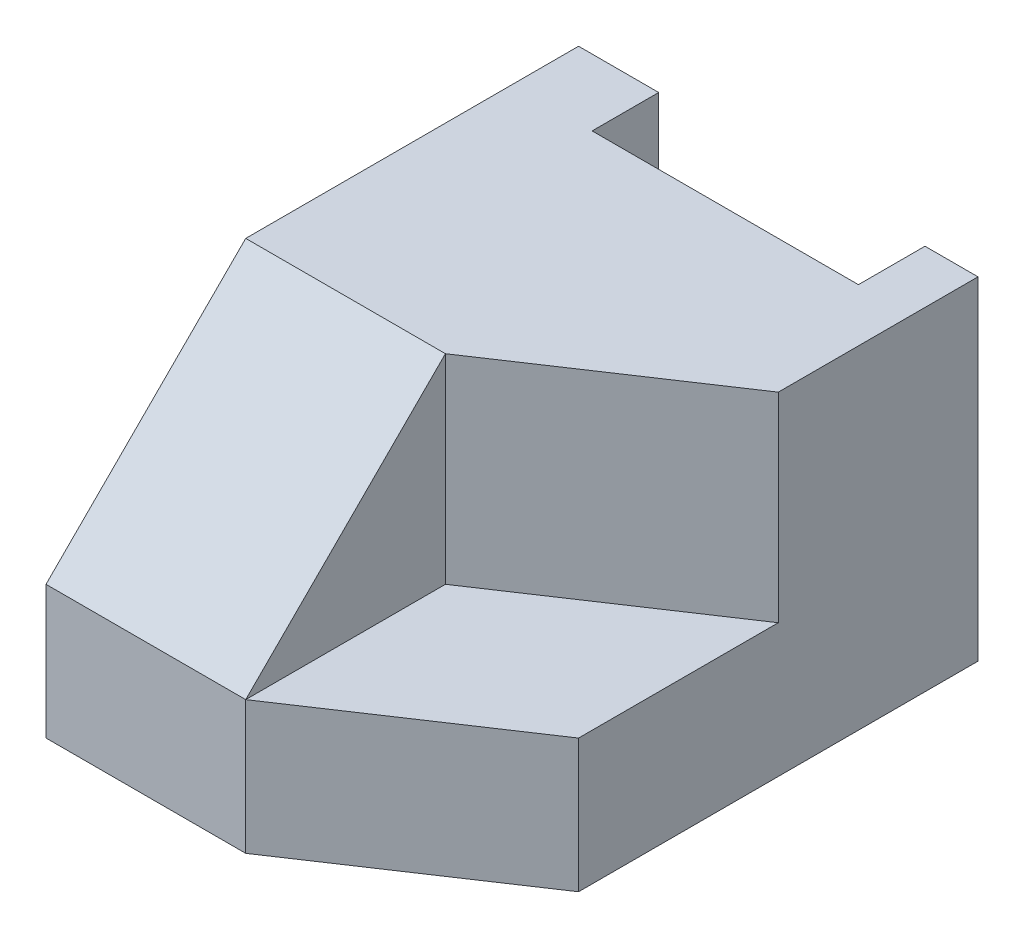
ISO-10303-21;
HEADER;
FILE_DESCRIPTION(('STEP AP214'),'2;1');
FILE_NAME('part.step','',(''),(''),'','','');
FILE_SCHEMA(('AUTOMOTIVE_DESIGN { 1 0 10303 214 1 1 1 1 }'));
ENDSEC;
DATA;
#1=APPLICATION_CONTEXT('core data for automotive mechanical design processes');
#2=APPLICATION_PROTOCOL_DEFINITION('international standard','automotive_design',2000,#1);
#3=PRODUCT_CONTEXT('',#1,'mechanical');
#4=PRODUCT('Part','Part','',(#3));
#5=PRODUCT_RELATED_PRODUCT_CATEGORY('part','',(#4));
#6=PRODUCT_DEFINITION_FORMATION('','',#4);
#7=PRODUCT_DEFINITION_CONTEXT('part definition',#1,'design');
#8=PRODUCT_DEFINITION('design','',#6,#7);
#9=PRODUCT_DEFINITION_SHAPE('','',#8);
#10=(LENGTH_UNIT() NAMED_UNIT(*) SI_UNIT(.MILLI.,.METRE.));
#11=(NAMED_UNIT(*) PLANE_ANGLE_UNIT() SI_UNIT($,.RADIAN.));
#12=(NAMED_UNIT(*) SI_UNIT($,.STERADIAN.) SOLID_ANGLE_UNIT());
#13=UNCERTAINTY_MEASURE_WITH_UNIT(LENGTH_MEASURE(1.E-05),#10,'distance_accuracy_value','');
#14=(GEOMETRIC_REPRESENTATION_CONTEXT(3) GLOBAL_UNCERTAINTY_ASSIGNED_CONTEXT((#13)) GLOBAL_UNIT_ASSIGNED_CONTEXT((#10,
#11,#12)) REPRESENTATION_CONTEXT('',''));
#15=CARTESIAN_POINT('',(0.,0.,0.));
#16=DIRECTION('',(0.,0.,1.));
#17=DIRECTION('',(1.,0.,0.));
#18=AXIS2_PLACEMENT_3D('',#15,#16,#17);
#19=CARTESIAN_POINT('',(-30.,50.,-40.));
#20=DIRECTION('',(0.,0.,1.));
#21=DIRECTION('',(1.,0.,0.));
#22=AXIS2_PLACEMENT_3D('',#19,#20,#21);
#23=PLANE('',#22);
#24=DIRECTION('',(-1.,0.,0.));
#25=VECTOR('',#24,1.);
#26=CARTESIAN_POINT('',(-30.,0.,-40.));
#27=LINE('',#26,#25);
#28=CARTESIAN_POINT('',(30.,0.,-40.));
#29=VERTEX_POINT('',#28);
#30=CARTESIAN_POINT('',(22.0372338214082,0.,-40.));
#31=VERTEX_POINT('',#30);
#32=EDGE_CURVE('E170',#29,#31,#27,.T.);
#33=ORIENTED_EDGE('',*,*,#32,.T.);
#34=DIRECTION('',(0.,1.,0.));
#35=VECTOR('',#34,1.);
#36=CARTESIAN_POINT('',(22.0372338214082,0.,-40.));
#37=LINE('',#36,#35);
#38=CARTESIAN_POINT('',(22.0372338214082,50.,-40.));
#39=VERTEX_POINT('',#38);
#40=EDGE_CURVE('E183',#31,#39,#37,.T.);
#41=ORIENTED_EDGE('',*,*,#40,.T.);
#42=DIRECTION('',(-1.,0.,0.));
#43=VECTOR('',#42,1.);
#44=CARTESIAN_POINT('',(-30.,50.,-40.));
#45=LINE('',#44,#43);
#46=CARTESIAN_POINT('',(30.,50.,-40.));
#47=VERTEX_POINT('',#46);
#48=EDGE_CURVE('E178',#47,#39,#45,.T.);
#49=ORIENTED_EDGE('',*,*,#48,.F.);
#50=DIRECTION('',(0.,-1.,0.));
#51=VECTOR('',#50,1.);
#52=CARTESIAN_POINT('',(30.,50.,-40.));
#53=LINE('',#52,#51);
#54=EDGE_CURVE('E156',#47,#29,#53,.T.);
#55=ORIENTED_EDGE('',*,*,#54,.T.);
#56=EDGE_LOOP('',(#33,#41,#49,#55));
#57=FACE_BOUND('',#56,.T.);
#58=ADVANCED_FACE('F33',(#57),#23,.F.);
#59=CARTESIAN_POINT('',(30.,50.,40.));
#60=DIRECTION('',(-1.,0.,0.));
#61=DIRECTION('',(0.,0.,1.));
#62=AXIS2_PLACEMENT_3D('',#59,#60,#61);
#63=PLANE('',#62);
#64=DIRECTION('',(0.,0.,-1.));
#65=VECTOR('',#64,1.);
#66=CARTESIAN_POINT('',(30.,20.,-10.));
#67=LINE('',#66,#65);
#68=CARTESIAN_POINT('',(30.,20.,20.));
#69=VERTEX_POINT('',#68);
#70=CARTESIAN_POINT('',(30.,20.,-10.));
#71=VERTEX_POINT('',#70);
#72=EDGE_CURVE('E151',#69,#71,#67,.T.);
#73=ORIENTED_EDGE('',*,*,#72,.F.);
#74=DIRECTION('',(0.,1.,0.));
#75=VECTOR('',#74,1.);
#76=CARTESIAN_POINT('',(30.,-9.99999999999999,20.));
#77=LINE('',#76,#75);
#78=CARTESIAN_POINT('',(30.,0.,20.));
#79=VERTEX_POINT('',#78);
#80=EDGE_CURVE('E138',#79,#69,#77,.T.);
#81=ORIENTED_EDGE('',*,*,#80,.F.);
#82=DIRECTION('',(0.,0.,-1.));
#83=VECTOR('',#82,1.);
#84=CARTESIAN_POINT('',(30.,0.,40.));
#85=LINE('',#84,#83);
#86=EDGE_CURVE('E174',#79,#29,#85,.T.);
#87=ORIENTED_EDGE('',*,*,#86,.T.);
#88=ORIENTED_EDGE('',*,*,#54,.F.);
#89=DIRECTION('',(0.,0.,-1.));
#90=VECTOR('',#89,1.);
#91=CARTESIAN_POINT('',(30.,50.,40.));
#92=LINE('',#91,#90);
#93=CARTESIAN_POINT('',(30.,50.,-10.));
#94=VERTEX_POINT('',#93);
#95=EDGE_CURVE('E166',#94,#47,#92,.T.);
#96=ORIENTED_EDGE('',*,*,#95,.F.);
#97=DIRECTION('',(0.,1.,0.));
#98=VECTOR('',#97,1.);
#99=CARTESIAN_POINT('',(30.,20.,-10.));
#100=LINE('',#99,#98);
#101=EDGE_CURVE('E208',#71,#94,#100,.T.);
#102=ORIENTED_EDGE('',*,*,#101,.F.);
#103=EDGE_LOOP('',(#73,#81,#87,#88,#96,#102));
#104=FACE_BOUND('',#103,.T.);
#105=ADVANCED_FACE('F218',(#104),#63,.F.);
#106=CARTESIAN_POINT('',(-17.9627661785918,50.,-40.));
#107=VERTEX_POINT('',#106);
#108=CARTESIAN_POINT('',(-30.,50.,-40.));
#109=VERTEX_POINT('',#108);
#110=EDGE_CURVE('E181',#107,#109,#45,.T.);
#111=ORIENTED_EDGE('',*,*,#110,.F.);
#112=DIRECTION('',(0.,1.,0.));
#113=VECTOR('',#112,1.);
#114=CARTESIAN_POINT('',(-17.9627661785918,0.,-40.));
#115=LINE('',#114,#113);
#116=CARTESIAN_POINT('',(-17.9627661785918,0.,-40.));
#117=VERTEX_POINT('',#116);
#118=EDGE_CURVE('E186',#117,#107,#115,.T.);
#119=ORIENTED_EDGE('',*,*,#118,.F.);
#120=CARTESIAN_POINT('',(-30.,0.,-40.));
#121=VERTEX_POINT('',#120);
#122=EDGE_CURVE('E173',#117,#121,#27,.T.);
#123=ORIENTED_EDGE('',*,*,#122,.T.);
#124=DIRECTION('',(0.,-1.,0.));
#125=VECTOR('',#124,1.);
#126=CARTESIAN_POINT('',(-30.,50.,-40.));
#127=LINE('',#126,#125);
#128=EDGE_CURVE('E159',#109,#121,#127,.T.);
#129=ORIENTED_EDGE('',*,*,#128,.F.);
#130=EDGE_LOOP('',(#111,#119,#123,#129));
#131=FACE_BOUND('',#130,.T.);
#132=ADVANCED_FACE('F244',(#131),#23,.F.);
#133=CARTESIAN_POINT('',(-30.,50.,40.));
#134=DIRECTION('',(1.,0.,0.));
#135=DIRECTION('',(0.,0.,-1.));
#136=AXIS2_PLACEMENT_3D('',#133,#134,#135);
#137=PLANE('',#136);
#138=DIRECTION('',(0.,-1.,0.));
#139=VECTOR('',#138,1.);
#140=CARTESIAN_POINT('',(-30.,50.,40.));
#141=LINE('',#140,#139);
#142=CARTESIAN_POINT('',(-30.,19.9999999999999,40.));
#143=VERTEX_POINT('',#142);
#144=CARTESIAN_POINT('',(-30.,0.,40.));
#145=VERTEX_POINT('',#144);
#146=EDGE_CURVE('E162',#143,#145,#141,.T.);
#147=ORIENTED_EDGE('',*,*,#146,.F.);
#148=DIRECTION('',(0.,-0.707106781186549,0.707106781186546));
#149=VECTOR('',#148,1.);
#150=CARTESIAN_POINT('',(-30.,50.,9.99999999999998));
#151=LINE('',#150,#149);
#152=CARTESIAN_POINT('',(-30.,50.,9.99999999999999));
#153=VERTEX_POINT('',#152);
#154=EDGE_CURVE('E11',#143,#153,#151,.F.);
#155=ORIENTED_EDGE('',*,*,#154,.T.);
#156=DIRECTION('',(0.,0.,1.));
#157=VECTOR('',#156,1.);
#158=CARTESIAN_POINT('',(-30.,50.,40.));
#159=LINE('',#158,#157);
#160=EDGE_CURVE('E164',#109,#153,#159,.T.);
#161=ORIENTED_EDGE('',*,*,#160,.F.);
#162=ORIENTED_EDGE('',*,*,#128,.T.);
#163=DIRECTION('',(0.,0.,1.));
#164=VECTOR('',#163,1.);
#165=CARTESIAN_POINT('',(-30.,0.,40.));
#166=LINE('',#165,#164);
#167=EDGE_CURVE('E167',#121,#145,#166,.T.);
#168=ORIENTED_EDGE('',*,*,#167,.T.);
#169=EDGE_LOOP('',(#147,#155,#161,#162,#168));
#170=FACE_BOUND('',#169,.T.);
#171=ADVANCED_FACE('F250',(#170),#137,.F.);
#172=CARTESIAN_POINT('',(-30.,50.,40.));
#173=DIRECTION('',(0.,0.,-1.));
#174=DIRECTION('',(-1.,0.,0.));
#175=AXIS2_PLACEMENT_3D('',#172,#173,#174);
#176=PLANE('',#175);
#177=DIRECTION('',(0.,1.,0.));
#178=VECTOR('',#177,1.);
#179=CARTESIAN_POINT('',(0.,-9.99999999999999,40.));
#180=LINE('',#179,#178);
#181=CARTESIAN_POINT('',(0.,0.,40.));
#182=VERTEX_POINT('',#181);
#183=CARTESIAN_POINT('',(0.,20.,40.));
#184=VERTEX_POINT('',#183);
#185=EDGE_CURVE('E135',#182,#184,#180,.T.);
#186=ORIENTED_EDGE('',*,*,#185,.T.);
#187=DIRECTION('',(-1.,0.,0.));
#188=VECTOR('',#187,1.);
#189=CARTESIAN_POINT('',(-30.,19.9999999999999,40.));
#190=LINE('',#189,#188);
#191=EDGE_CURVE('E41',#184,#143,#190,.T.);
#192=ORIENTED_EDGE('',*,*,#191,.T.);
#193=ORIENTED_EDGE('',*,*,#146,.T.);
#194=DIRECTION('',(1.,0.,0.));
#195=VECTOR('',#194,1.);
#196=CARTESIAN_POINT('',(-30.,0.,40.));
#197=LINE('',#196,#195);
#198=EDGE_CURVE('E145',#145,#182,#197,.T.);
#199=ORIENTED_EDGE('',*,*,#198,.T.);
#200=EDGE_LOOP('',(#186,#192,#193,#199));
#201=FACE_BOUND('',#200,.T.);
#202=ADVANCED_FACE('F143',(#201),#176,.F.);
#203=CARTESIAN_POINT('',(0.,50.,0.));
#204=DIRECTION('',(0.,-1.,0.));
#205=DIRECTION('',(0.,0.,-1.));
#206=AXIS2_PLACEMENT_3D('',#203,#204,#205);
#207=PLANE('',#206);
#208=ORIENTED_EDGE('',*,*,#160,.T.);
#209=DIRECTION('',(1.,0.,0.));
#210=VECTOR('',#209,1.);
#211=CARTESIAN_POINT('',(0.,50.,9.99999999999998));
#212=LINE('',#211,#210);
#213=CARTESIAN_POINT('',(0.,50.,9.99999999999999));
#214=VERTEX_POINT('',#213);
#215=EDGE_CURVE('E129',#153,#214,#212,.T.);
#216=ORIENTED_EDGE('',*,*,#215,.T.);
#217=DIRECTION('',(-0.832050294337843,0.,0.554700196225229));
#218=VECTOR('',#217,1.);
#219=CARTESIAN_POINT('',(0.,50.,9.99999999999999));
#220=LINE('',#219,#218);
#221=EDGE_CURVE('E152',#94,#214,#220,.T.);
#222=ORIENTED_EDGE('',*,*,#221,.F.);
#223=ORIENTED_EDGE('',*,*,#95,.T.);
#224=ORIENTED_EDGE('',*,*,#48,.T.);
#225=DIRECTION('',(0.,0.,-1.));
#226=VECTOR('',#225,1.);
#227=CARTESIAN_POINT('',(22.0372338214082,50.,-40.));
#228=LINE('',#227,#226);
#229=CARTESIAN_POINT('',(22.0372338214082,50.,-30.));
#230=VERTEX_POINT('',#229);
#231=EDGE_CURVE('E199',#230,#39,#228,.T.);
#232=ORIENTED_EDGE('',*,*,#231,.F.);
#233=DIRECTION('',(1.,0.,0.));
#234=VECTOR('',#233,1.);
#235=CARTESIAN_POINT('',(22.0372338214082,50.,-30.));
#236=LINE('',#235,#234);
#237=CARTESIAN_POINT('',(-17.9627661785918,50.,-30.));
#238=VERTEX_POINT('',#237);
#239=EDGE_CURVE('E192',#238,#230,#236,.T.);
#240=ORIENTED_EDGE('',*,*,#239,.F.);
#241=DIRECTION('',(0.,0.,1.));
#242=VECTOR('',#241,1.);
#243=CARTESIAN_POINT('',(-17.9627661785918,50.,-40.));
#244=LINE('',#243,#242);
#245=EDGE_CURVE('E196',#107,#238,#244,.T.);
#246=ORIENTED_EDGE('',*,*,#245,.F.);
#247=ORIENTED_EDGE('',*,*,#110,.T.);
#248=EDGE_LOOP('',(#208,#216,#222,#223,#224,#232,#240,#246,#247));
#249=FACE_BOUND('',#248,.T.);
#250=ADVANCED_FACE('F229',(#249),#207,.F.);
#251=CARTESIAN_POINT('',(0.,0.,0.));
#252=DIRECTION('',(0.,-1.,0.));
#253=DIRECTION('',(0.,0.,-1.));
#254=AXIS2_PLACEMENT_3D('',#251,#252,#253);
#255=PLANE('',#254);
#256=DIRECTION('',(0.832050294337844,0.,-0.554700196225229));
#257=VECTOR('',#256,1.);
#258=CARTESIAN_POINT('',(18.4615384615385,0.,27.6923076923077));
#259=LINE('',#258,#257);
#260=EDGE_CURVE('E146',#182,#79,#259,.T.);
#261=ORIENTED_EDGE('',*,*,#260,.F.);
#262=ORIENTED_EDGE('',*,*,#198,.F.);
#263=ORIENTED_EDGE('',*,*,#167,.F.);
#264=ORIENTED_EDGE('',*,*,#122,.F.);
#265=DIRECTION('',(0.,0.,1.));
#266=VECTOR('',#265,1.);
#267=CARTESIAN_POINT('',(-17.9627661785918,0.,-40.));
#268=LINE('',#267,#266);
#269=CARTESIAN_POINT('',(-17.9627661785918,0.,-30.));
#270=VERTEX_POINT('',#269);
#271=EDGE_CURVE('E203',#117,#270,#268,.T.);
#272=ORIENTED_EDGE('',*,*,#271,.T.);
#273=DIRECTION('',(1.,0.,0.));
#274=VECTOR('',#273,1.);
#275=CARTESIAN_POINT('',(22.0372338214082,0.,-30.));
#276=LINE('',#275,#274);
#277=CARTESIAN_POINT('',(22.0372338214082,0.,-30.));
#278=VERTEX_POINT('',#277);
#279=EDGE_CURVE('E187',#270,#278,#276,.T.);
#280=ORIENTED_EDGE('',*,*,#279,.T.);
#281=DIRECTION('',(0.,0.,-1.));
#282=VECTOR('',#281,1.);
#283=CARTESIAN_POINT('',(22.0372338214082,0.,-40.));
#284=LINE('',#283,#282);
#285=EDGE_CURVE('E195',#278,#31,#284,.T.);
#286=ORIENTED_EDGE('',*,*,#285,.T.);
#287=ORIENTED_EDGE('',*,*,#32,.F.);
#288=ORIENTED_EDGE('',*,*,#86,.F.);
#289=EDGE_LOOP('',(#261,#262,#263,#264,#272,#280,#286,#287,#288));
#290=FACE_BOUND('',#289,.T.);
#291=ADVANCED_FACE('F222',(#290),#255,.T.);
#292=CARTESIAN_POINT('',(22.0372338214082,0.,-40.));
#293=DIRECTION('',(1.,0.,0.));
#294=DIRECTION('',(0.,0.,-1.));
#295=AXIS2_PLACEMENT_3D('',#292,#293,#294);
#296=PLANE('',#295);
#297=ORIENTED_EDGE('',*,*,#231,.T.);
#298=ORIENTED_EDGE('',*,*,#40,.F.);
#299=ORIENTED_EDGE('',*,*,#285,.F.);
#300=DIRECTION('',(0.,1.,0.));
#301=VECTOR('',#300,1.);
#302=CARTESIAN_POINT('',(22.0372338214082,0.,-30.));
#303=LINE('',#302,#301);
#304=EDGE_CURVE('E176',#278,#230,#303,.T.);
#305=ORIENTED_EDGE('',*,*,#304,.T.);
#306=EDGE_LOOP('',(#297,#298,#299,#305));
#307=FACE_BOUND('',#306,.T.);
#308=ADVANCED_FACE('F267',(#307),#296,.F.);
#309=CARTESIAN_POINT('',(22.0372338214082,0.,-30.));
#310=DIRECTION('',(0.,0.,1.));
#311=DIRECTION('',(1.,0.,0.));
#312=AXIS2_PLACEMENT_3D('',#309,#310,#311);
#313=PLANE('',#312);
#314=ORIENTED_EDGE('',*,*,#239,.T.);
#315=ORIENTED_EDGE('',*,*,#304,.F.);
#316=ORIENTED_EDGE('',*,*,#279,.F.);
#317=DIRECTION('',(0.,1.,0.));
#318=VECTOR('',#317,1.);
#319=CARTESIAN_POINT('',(-17.9627661785918,0.,-30.));
#320=LINE('',#319,#318);
#321=EDGE_CURVE('E189',#270,#238,#320,.T.);
#322=ORIENTED_EDGE('',*,*,#321,.T.);
#323=EDGE_LOOP('',(#314,#315,#316,#322));
#324=FACE_BOUND('',#323,.T.);
#325=ADVANCED_FACE('F265',(#324),#313,.F.);
#326=CARTESIAN_POINT('',(-17.9627661785918,0.,-40.));
#327=DIRECTION('',(-1.,0.,0.));
#328=DIRECTION('',(0.,0.,1.));
#329=AXIS2_PLACEMENT_3D('',#326,#327,#328);
#330=PLANE('',#329);
#331=ORIENTED_EDGE('',*,*,#245,.T.);
#332=ORIENTED_EDGE('',*,*,#321,.F.);
#333=ORIENTED_EDGE('',*,*,#271,.F.);
#334=ORIENTED_EDGE('',*,*,#118,.T.);
#335=EDGE_LOOP('',(#331,#332,#333,#334));
#336=FACE_BOUND('',#335,.T.);
#337=ADVANCED_FACE('F240',(#336),#330,.F.);
#338=CARTESIAN_POINT('',(0.,20.,40.));
#339=DIRECTION('',(-1.,0.,0.));
#340=DIRECTION('',(0.,0.,1.));
#341=AXIS2_PLACEMENT_3D('',#338,#339,#340);
#342=PLANE('',#341);
#343=DIRECTION('',(0.,1.,0.));
#344=VECTOR('',#343,1.);
#345=CARTESIAN_POINT('',(0.,20.,9.99999999999999));
#346=LINE('',#345,#344);
#347=CARTESIAN_POINT('',(0.,20.,9.99999999999999));
#348=VERTEX_POINT('',#347);
#349=EDGE_CURVE('E124',#348,#214,#346,.T.);
#350=ORIENTED_EDGE('',*,*,#349,.T.);
#351=DIRECTION('',(0.,0.707106781186549,-0.707106781186546));
#352=VECTOR('',#351,1.);
#353=CARTESIAN_POINT('',(0.,50.,9.99999999999998));
#354=LINE('',#353,#352);
#355=EDGE_CURVE('E118',#214,#184,#354,.F.);
#356=ORIENTED_EDGE('',*,*,#355,.T.);
#357=DIRECTION('',(0.,0.,1.));
#358=VECTOR('',#357,1.);
#359=CARTESIAN_POINT('',(0.,20.,40.));
#360=LINE('',#359,#358);
#361=EDGE_CURVE('E122',#348,#184,#360,.T.);
#362=ORIENTED_EDGE('',*,*,#361,.F.);
#363=EDGE_LOOP('',(#350,#356,#362));
#364=FACE_BOUND('',#363,.T.);
#365=ADVANCED_FACE('F120',(#364),#342,.F.);
#366=CARTESIAN_POINT('',(0.,20.,9.99999999999999));
#367=DIRECTION('',(-0.554700196225229,0.,-0.832050294337843));
#368=DIRECTION('',(-0.832050294337844,0.,0.554700196225229));
#369=AXIS2_PLACEMENT_3D('',#366,#367,#368);
#370=PLANE('',#369);
#371=ORIENTED_EDGE('',*,*,#221,.T.);
#372=ORIENTED_EDGE('',*,*,#349,.F.);
#373=DIRECTION('',(-0.832050294337843,0.,0.554700196225229));
#374=VECTOR('',#373,1.);
#375=CARTESIAN_POINT('',(0.,20.,9.99999999999999));
#376=LINE('',#375,#374);
#377=EDGE_CURVE('E150',#71,#348,#376,.T.);
#378=ORIENTED_EDGE('',*,*,#377,.F.);
#379=ORIENTED_EDGE('',*,*,#101,.T.);
#380=EDGE_LOOP('',(#371,#372,#378,#379));
#381=FACE_BOUND('',#380,.T.);
#382=ADVANCED_FACE('F232',(#381),#370,.F.);
#383=CARTESIAN_POINT('',(0.,20.,0.));
#384=DIRECTION('',(0.,1.,0.));
#385=DIRECTION('',(0.,0.,1.));
#386=AXIS2_PLACEMENT_3D('',#383,#384,#385);
#387=PLANE('',#386);
#388=DIRECTION('',(-0.832050294337844,0.,0.554700196225229));
#389=VECTOR('',#388,1.);
#390=CARTESIAN_POINT('',(0.,20.,40.));
#391=LINE('',#390,#389);
#392=EDGE_CURVE('E133',#69,#184,#391,.T.);
#393=ORIENTED_EDGE('',*,*,#392,.F.);
#394=ORIENTED_EDGE('',*,*,#72,.T.);
#395=ORIENTED_EDGE('',*,*,#377,.T.);
#396=ORIENTED_EDGE('',*,*,#361,.T.);
#397=EDGE_LOOP('',(#393,#394,#395,#396));
#398=FACE_BOUND('',#397,.T.);
#399=ADVANCED_FACE('F148',(#398),#387,.T.);
#400=CARTESIAN_POINT('',(0.,-9.99999999999999,40.));
#401=DIRECTION('',(-0.554700196225229,0.,-0.832050294337844));
#402=DIRECTION('',(-0.832050294337844,0.,0.554700196225229));
#403=AXIS2_PLACEMENT_3D('',#400,#401,#402);
#404=PLANE('',#403);
#405=ORIENTED_EDGE('',*,*,#260,.T.);
#406=ORIENTED_EDGE('',*,*,#80,.T.);
#407=ORIENTED_EDGE('',*,*,#392,.T.);
#408=ORIENTED_EDGE('',*,*,#185,.F.);
#409=EDGE_LOOP('',(#405,#406,#407,#408));
#410=FACE_BOUND('',#409,.T.);
#411=ADVANCED_FACE('F134',(#410),#404,.F.);
#412=CARTESIAN_POINT('',(0.,50.,9.99999999999998));
#413=DIRECTION('',(0.,-0.707106781186546,-0.707106781186549));
#414=DIRECTION('',(1.,0.,0.));
#415=AXIS2_PLACEMENT_3D('',#412,#413,#414);
#416=PLANE('',#415);
#417=ORIENTED_EDGE('',*,*,#154,.F.);
#418=ORIENTED_EDGE('',*,*,#191,.F.);
#419=ORIENTED_EDGE('',*,*,#355,.F.);
#420=ORIENTED_EDGE('',*,*,#215,.F.);
#421=EDGE_LOOP('',(#417,#418,#419,#420));
#422=FACE_BOUND('',#421,.T.);
#423=ADVANCED_FACE('F35',(#422),#416,.F.);
#424=CLOSED_SHELL('',(#58,#105,#132,#171,#202,#250,#291,#308,#325,#337,#365,#382,#399,#411,#423));
#425=MANIFOLD_SOLID_BREP('B2',#424);
#426=ADVANCED_BREP_SHAPE_REPRESENTATION('',(#18,#425),#14);
#427=SHAPE_DEFINITION_REPRESENTATION(#9,#426);
ENDSEC;
END-ISO-10303-21;
